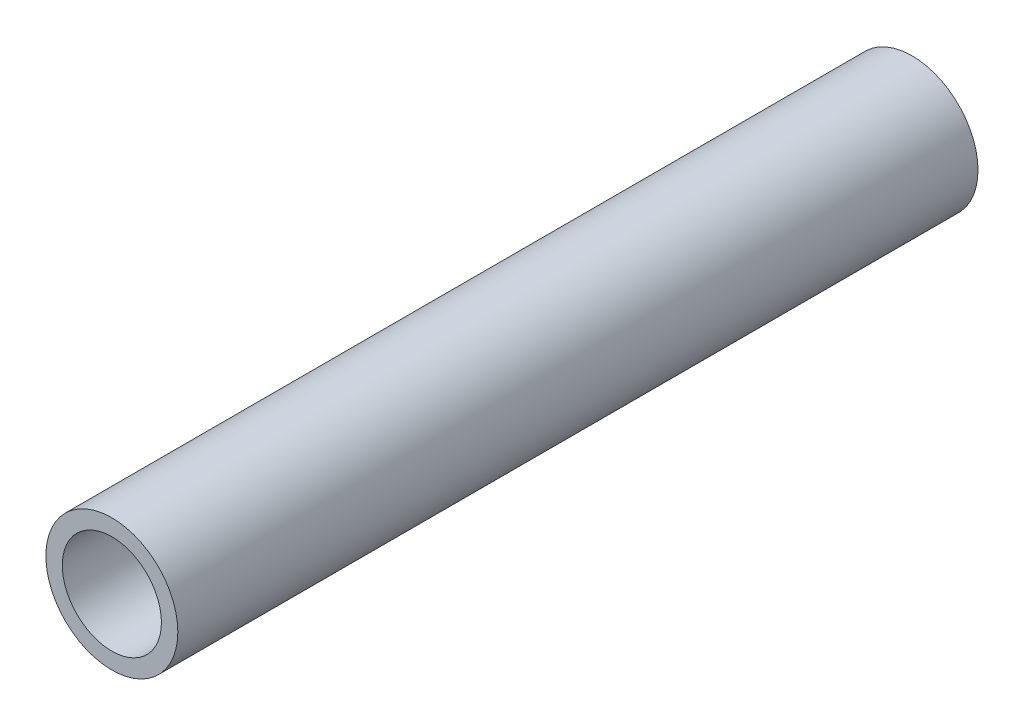
ISO-10303-21;
HEADER;
FILE_DESCRIPTION(('STEP AP214'),'2;1');
FILE_NAME('part.step','',(''),(''),'','','');
FILE_SCHEMA(('AUTOMOTIVE_DESIGN { 1 0 10303 214 1 1 1 1 }'));
ENDSEC;
DATA;
#1=APPLICATION_CONTEXT('core data for automotive mechanical design processes');
#2=APPLICATION_PROTOCOL_DEFINITION('international standard','automotive_design',2000,#1);
#3=PRODUCT_CONTEXT('',#1,'mechanical');
#4=PRODUCT('Part','Part','',(#3));
#5=PRODUCT_RELATED_PRODUCT_CATEGORY('part','',(#4));
#6=PRODUCT_DEFINITION_FORMATION('','',#4);
#7=PRODUCT_DEFINITION_CONTEXT('part definition',#1,'design');
#8=PRODUCT_DEFINITION('design','',#6,#7);
#9=PRODUCT_DEFINITION_SHAPE('','',#8);
#10=(LENGTH_UNIT() NAMED_UNIT(*) SI_UNIT(.MILLI.,.METRE.));
#11=(NAMED_UNIT(*) PLANE_ANGLE_UNIT() SI_UNIT($,.RADIAN.));
#12=(NAMED_UNIT(*) SI_UNIT($,.STERADIAN.) SOLID_ANGLE_UNIT());
#13=UNCERTAINTY_MEASURE_WITH_UNIT(LENGTH_MEASURE(1.E-05),#10,'distance_accuracy_value','');
#14=(GEOMETRIC_REPRESENTATION_CONTEXT(3) GLOBAL_UNCERTAINTY_ASSIGNED_CONTEXT((#13)) GLOBAL_UNIT_ASSIGNED_CONTEXT((#10,
#11,#12)) REPRESENTATION_CONTEXT('',''));
#15=CARTESIAN_POINT('',(0.,0.,0.));
#16=DIRECTION('',(0.,0.,1.));
#17=DIRECTION('',(1.,0.,0.));
#18=AXIS2_PLACEMENT_3D('',#15,#16,#17);
#19=CARTESIAN_POINT('',(0.,0.,0.));
#20=DIRECTION('',(0.,0.,1.));
#21=DIRECTION('',(1.,0.,0.));
#22=AXIS2_PLACEMENT_3D('',#19,#20,#21);
#23=CYLINDRICAL_SURFACE('',#22,1.78435);
#24=CARTESIAN_POINT('',(0.,0.,28.8036));
#25=DIRECTION('',(0.,0.,1.));
#26=DIRECTION('',(1.,0.,0.));
#27=AXIS2_PLACEMENT_3D('',#24,#25,#26);
#28=CIRCLE('',#27,1.78435);
#29=CARTESIAN_POINT('',(1.78435,0.,28.8036));
#30=VERTEX_POINT('',#29);
#31=EDGE_CURVE('E18',#30,#30,#28,.T.);
#32=ORIENTED_EDGE('',*,*,#31,.T.);
#33=EDGE_LOOP('',(#32));
#34=FACE_BOUND('',#33,.T.);
#35=CARTESIAN_POINT('',(0.,0.,0.));
#36=DIRECTION('',(0.,0.,1.));
#37=DIRECTION('',(1.,0.,0.));
#38=AXIS2_PLACEMENT_3D('',#35,#36,#37);
#39=CIRCLE('',#38,1.78435);
#40=CARTESIAN_POINT('',(1.78435,0.,0.));
#41=VERTEX_POINT('',#40);
#42=EDGE_CURVE('E31',#41,#41,#39,.T.);
#43=ORIENTED_EDGE('',*,*,#42,.F.);
#44=EDGE_LOOP('',(#43));
#45=FACE_BOUND('',#44,.T.);
#46=ADVANCED_FACE('F14',(#34,#45),#23,.F.);
#47=CARTESIAN_POINT('',(2.4033988,-2.4033988,28.8036));
#48=DIRECTION('',(0.,0.,-1.));
#49=DIRECTION('',(-1.,0.,0.));
#50=AXIS2_PLACEMENT_3D('',#47,#48,#49);
#51=PLANE('',#50);
#52=ORIENTED_EDGE('',*,*,#31,.F.);
#53=EDGE_LOOP('',(#52));
#54=FACE_BOUND('',#53,.T.);
#55=CARTESIAN_POINT('',(0.,0.,28.8036));
#56=DIRECTION('',(0.,0.,1.));
#57=DIRECTION('',(1.,0.,0.));
#58=AXIS2_PLACEMENT_3D('',#55,#56,#57);
#59=CIRCLE('',#58,2.3749);
#60=CARTESIAN_POINT('',(2.3749,0.,28.8036));
#61=VERTEX_POINT('',#60);
#62=EDGE_CURVE('E23',#61,#61,#59,.T.);
#63=ORIENTED_EDGE('',*,*,#62,.T.);
#64=EDGE_LOOP('',(#63));
#65=FACE_BOUND('',#64,.T.);
#66=ADVANCED_FACE('F42',(#54,#65),#51,.F.);
#67=CARTESIAN_POINT('',(2.4033988,-2.4033988,0.));
#68=DIRECTION('',(0.,0.,-1.));
#69=DIRECTION('',(-1.,0.,0.));
#70=AXIS2_PLACEMENT_3D('',#67,#68,#69);
#71=PLANE('',#70);
#72=ORIENTED_EDGE('',*,*,#42,.T.);
#73=EDGE_LOOP('',(#72));
#74=FACE_BOUND('',#73,.T.);
#75=CARTESIAN_POINT('',(0.,0.,0.));
#76=DIRECTION('',(0.,0.,1.));
#77=DIRECTION('',(1.,0.,0.));
#78=AXIS2_PLACEMENT_3D('',#75,#76,#77);
#79=CIRCLE('',#78,2.3749);
#80=CARTESIAN_POINT('',(2.3749,0.,0.));
#81=VERTEX_POINT('',#80);
#82=EDGE_CURVE('E10',#81,#81,#79,.F.);
#83=ORIENTED_EDGE('',*,*,#82,.T.);
#84=EDGE_LOOP('',(#83));
#85=FACE_BOUND('',#84,.T.);
#86=ADVANCED_FACE('F16',(#74,#85),#71,.T.);
#87=CARTESIAN_POINT('',(0.,0.,0.));
#88=DIRECTION('',(0.,0.,1.));
#89=DIRECTION('',(1.,0.,0.));
#90=AXIS2_PLACEMENT_3D('',#87,#88,#89);
#91=CYLINDRICAL_SURFACE('',#90,2.3749);
#92=ORIENTED_EDGE('',*,*,#62,.F.);
#93=EDGE_LOOP('',(#92));
#94=FACE_BOUND('',#93,.T.);
#95=ORIENTED_EDGE('',*,*,#82,.F.);
#96=EDGE_LOOP('',(#95));
#97=FACE_BOUND('',#96,.T.);
#98=ADVANCED_FACE('F47',(#94,#97),#91,.T.);
#99=CLOSED_SHELL('',(#46,#66,#86,#98));
#100=MANIFOLD_SOLID_BREP('B1',#99);
#101=ADVANCED_BREP_SHAPE_REPRESENTATION('',(#18,#100),#14);
#102=SHAPE_DEFINITION_REPRESENTATION(#9,#101);
ENDSEC;
END-ISO-10303-21;
